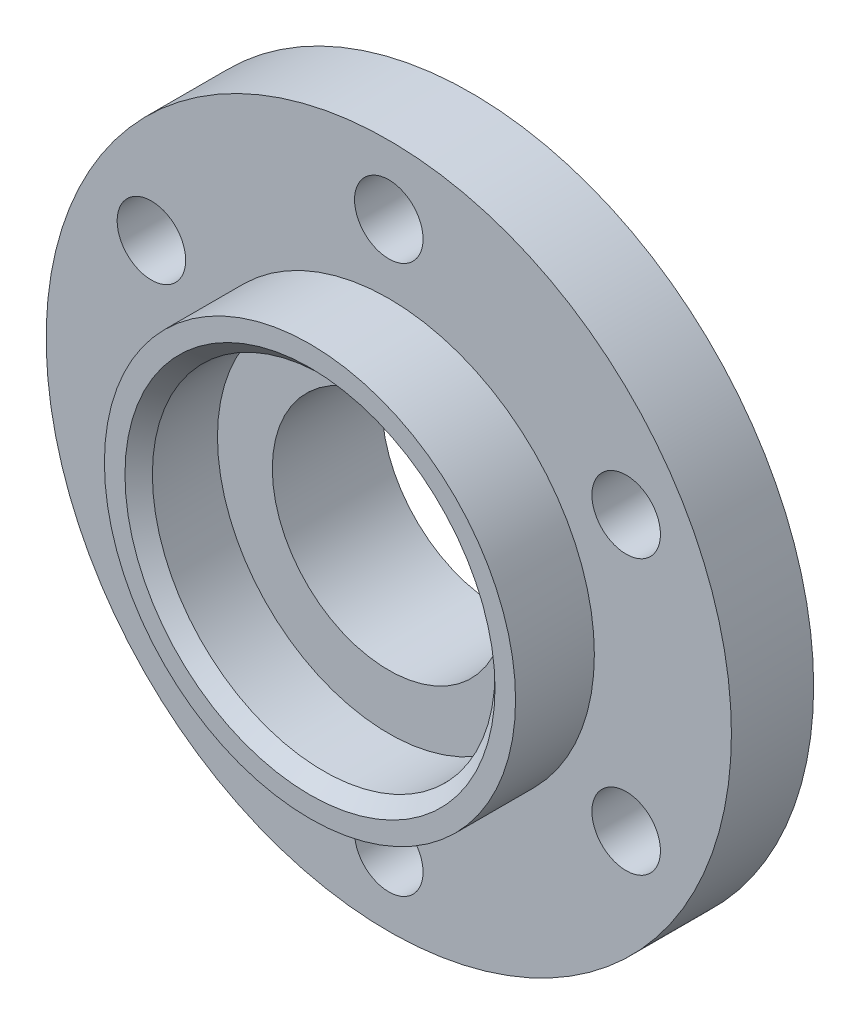
ISO-10303-21;
HEADER;
FILE_DESCRIPTION(('STEP AP214'),'2;1');
FILE_NAME('part.step','',(''),(''),'','','');
FILE_SCHEMA(('AUTOMOTIVE_DESIGN { 1 0 10303 214 1 1 1 1 }'));
ENDSEC;
DATA;
#1=APPLICATION_CONTEXT('core data for automotive mechanical design processes');
#2=APPLICATION_PROTOCOL_DEFINITION('international standard','automotive_design',2000,#1);
#3=PRODUCT_CONTEXT('',#1,'mechanical');
#4=PRODUCT('Part','Part','',(#3));
#5=PRODUCT_RELATED_PRODUCT_CATEGORY('part','',(#4));
#6=PRODUCT_DEFINITION_FORMATION('','',#4);
#7=PRODUCT_DEFINITION_CONTEXT('part definition',#1,'design');
#8=PRODUCT_DEFINITION('design','',#6,#7);
#9=PRODUCT_DEFINITION_SHAPE('','',#8);
#10=(LENGTH_UNIT() NAMED_UNIT(*) SI_UNIT(.MILLI.,.METRE.));
#11=(NAMED_UNIT(*) PLANE_ANGLE_UNIT() SI_UNIT($,.RADIAN.));
#12=(NAMED_UNIT(*) SI_UNIT($,.STERADIAN.) SOLID_ANGLE_UNIT());
#13=UNCERTAINTY_MEASURE_WITH_UNIT(LENGTH_MEASURE(1.E-05),#10,'distance_accuracy_value','');
#14=(GEOMETRIC_REPRESENTATION_CONTEXT(3) GLOBAL_UNCERTAINTY_ASSIGNED_CONTEXT((#13)) GLOBAL_UNIT_ASSIGNED_CONTEXT((#10,
#11,#12)) REPRESENTATION_CONTEXT('',''));
#15=CARTESIAN_POINT('',(0.,0.,0.));
#16=DIRECTION('',(0.,0.,1.));
#17=DIRECTION('',(1.,0.,0.));
#18=AXIS2_PLACEMENT_3D('',#15,#16,#17);
#19=CARTESIAN_POINT('',(0.,0.,0.));
#20=DIRECTION('',(0.,0.,1.));
#21=DIRECTION('',(1.,0.,0.));
#22=AXIS2_PLACEMENT_3D('',#19,#20,#21);
#23=PLANE('',#22);
#24=CARTESIAN_POINT('',(-17.3205080756887,10.0000000000002,0.));
#25=DIRECTION('',(0.,0.,-1.));
#26=DIRECTION('',(-1.,0.,0.));
#27=AXIS2_PLACEMENT_3D('',#24,#25,#26);
#28=CIRCLE('',#27,2.49999999999999);
#29=CARTESIAN_POINT('',(-19.8205080756886,10.0000000000002,0.));
#30=VERTEX_POINT('',#29);
#31=EDGE_CURVE('E71',#30,#30,#28,.T.);
#32=ORIENTED_EDGE('',*,*,#31,.F.);
#33=EDGE_LOOP('',(#32));
#34=FACE_BOUND('',#33,.T.);
#35=CARTESIAN_POINT('',(-17.3205080756889,-9.99999999999984,0.));
#36=DIRECTION('',(0.,0.,-1.));
#37=DIRECTION('',(-1.,0.,0.));
#38=AXIS2_PLACEMENT_3D('',#35,#36,#37);
#39=CIRCLE('',#38,2.49999999999999);
#40=CARTESIAN_POINT('',(-19.8205080756889,-9.99999999999984,0.));
#41=VERTEX_POINT('',#40);
#42=EDGE_CURVE('E61',#41,#41,#39,.T.);
#43=ORIENTED_EDGE('',*,*,#42,.F.);
#44=EDGE_LOOP('',(#43));
#45=FACE_BOUND('',#44,.T.);
#46=CARTESIAN_POINT('',(0.,-20.,0.));
#47=DIRECTION('',(0.,0.,-1.));
#48=DIRECTION('',(-1.,0.,0.));
#49=AXIS2_PLACEMENT_3D('',#46,#47,#48);
#50=CIRCLE('',#49,2.49999999999999);
#51=CARTESIAN_POINT('',(-2.49999999999999,-20.,0.));
#52=VERTEX_POINT('',#51);
#53=EDGE_CURVE('E58',#52,#52,#50,.T.);
#54=ORIENTED_EDGE('',*,*,#53,.F.);
#55=EDGE_LOOP('',(#54));
#56=FACE_BOUND('',#55,.T.);
#57=CARTESIAN_POINT('',(17.3205080756887,-10.0000000000001,0.));
#58=DIRECTION('',(0.,0.,-1.));
#59=DIRECTION('',(-1.,0.,0.));
#60=AXIS2_PLACEMENT_3D('',#57,#58,#59);
#61=CIRCLE('',#60,2.49999999999999);
#62=CARTESIAN_POINT('',(14.8205080756887,-10.0000000000001,0.));
#63=VERTEX_POINT('',#62);
#64=EDGE_CURVE('E57',#63,#63,#61,.T.);
#65=ORIENTED_EDGE('',*,*,#64,.F.);
#66=EDGE_LOOP('',(#65));
#67=FACE_BOUND('',#66,.T.);
#68=CARTESIAN_POINT('',(17.3205080756888,9.99999999999996,0.));
#69=DIRECTION('',(0.,0.,-1.));
#70=DIRECTION('',(-1.,0.,0.));
#71=AXIS2_PLACEMENT_3D('',#68,#69,#70);
#72=CIRCLE('',#71,2.49999999999999);
#73=CARTESIAN_POINT('',(14.8205080756888,9.99999999999996,0.));
#74=VERTEX_POINT('',#73);
#75=EDGE_CURVE('E54',#74,#74,#72,.T.);
#76=ORIENTED_EDGE('',*,*,#75,.F.);
#77=EDGE_LOOP('',(#76));
#78=FACE_BOUND('',#77,.T.);
#79=CARTESIAN_POINT('',(0.,20.,0.));
#80=DIRECTION('',(0.,0.,-1.));
#81=DIRECTION('',(-1.,0.,0.));
#82=AXIS2_PLACEMENT_3D('',#79,#80,#81);
#83=CIRCLE('',#82,2.49999999999999);
#84=CARTESIAN_POINT('',(-2.49999999999999,20.,0.));
#85=VERTEX_POINT('',#84);
#86=EDGE_CURVE('E53',#85,#85,#83,.T.);
#87=ORIENTED_EDGE('',*,*,#86,.F.);
#88=EDGE_LOOP('',(#87));
#89=FACE_BOUND('',#88,.T.);
#90=CARTESIAN_POINT('',(0.,0.,0.));
#91=DIRECTION('',(0.,0.,1.));
#92=DIRECTION('',(1.,0.,0.));
#93=AXIS2_PLACEMENT_3D('',#90,#91,#92);
#94=CIRCLE('',#93,25.);
#95=CARTESIAN_POINT('',(25.,0.,0.));
#96=VERTEX_POINT('',#95);
#97=EDGE_CURVE('E91',#96,#96,#94,.T.);
#98=ORIENTED_EDGE('',*,*,#97,.F.);
#99=EDGE_LOOP('',(#98));
#100=FACE_BOUND('',#99,.T.);
#101=CARTESIAN_POINT('',(0.,0.,0.));
#102=DIRECTION('',(0.,0.,1.));
#103=DIRECTION('',(1.,0.,0.));
#104=AXIS2_PLACEMENT_3D('',#101,#102,#103);
#105=CIRCLE('',#104,14.);
#106=CARTESIAN_POINT('',(14.,0.,0.));
#107=VERTEX_POINT('',#106);
#108=EDGE_CURVE('E102',#107,#107,#105,.F.);
#109=ORIENTED_EDGE('',*,*,#108,.F.);
#110=EDGE_LOOP('',(#109));
#111=FACE_BOUND('',#110,.T.);
#112=ADVANCED_FACE('F33',(#34,#45,#56,#67,#78,#89,#100,#111),#23,.F.);
#113=CARTESIAN_POINT('',(0.,0.,6.));
#114=DIRECTION('',(0.,0.,1.));
#115=DIRECTION('',(1.,0.,0.));
#116=AXIS2_PLACEMENT_3D('',#113,#114,#115);
#117=PLANE('',#116);
#118=CARTESIAN_POINT('',(-17.3205080756887,10.0000000000002,6.));
#119=DIRECTION('',(0.,0.,1.));
#120=DIRECTION('',(1.,0.,0.));
#121=AXIS2_PLACEMENT_3D('',#118,#119,#120);
#122=CIRCLE('',#121,2.49999999999999);
#123=CARTESIAN_POINT('',(-14.8205080756887,10.0000000000002,6.));
#124=VERTEX_POINT('',#123);
#125=EDGE_CURVE('E37',#124,#124,#122,.T.);
#126=ORIENTED_EDGE('',*,*,#125,.F.);
#127=EDGE_LOOP('',(#126));
#128=FACE_BOUND('',#127,.T.);
#129=CARTESIAN_POINT('',(-17.3205080756889,-9.99999999999984,6.));
#130=DIRECTION('',(0.,0.,1.));
#131=DIRECTION('',(1.,0.,0.));
#132=AXIS2_PLACEMENT_3D('',#129,#130,#131);
#133=CIRCLE('',#132,2.49999999999999);
#134=CARTESIAN_POINT('',(-14.8205080756889,-9.99999999999984,6.));
#135=VERTEX_POINT('',#134);
#136=EDGE_CURVE('E59',#135,#135,#133,.T.);
#137=ORIENTED_EDGE('',*,*,#136,.F.);
#138=EDGE_LOOP('',(#137));
#139=FACE_BOUND('',#138,.T.);
#140=CARTESIAN_POINT('',(0.,-20.,6.));
#141=DIRECTION('',(0.,0.,1.));
#142=DIRECTION('',(1.,0.,0.));
#143=AXIS2_PLACEMENT_3D('',#140,#141,#142);
#144=CIRCLE('',#143,2.49999999999999);
#145=CARTESIAN_POINT('',(2.49999999999999,-20.,6.));
#146=VERTEX_POINT('',#145);
#147=EDGE_CURVE('E55',#146,#146,#144,.T.);
#148=ORIENTED_EDGE('',*,*,#147,.F.);
#149=EDGE_LOOP('',(#148));
#150=FACE_BOUND('',#149,.T.);
#151=CARTESIAN_POINT('',(17.3205080756887,-10.0000000000001,6.));
#152=DIRECTION('',(0.,0.,1.));
#153=DIRECTION('',(1.,0.,0.));
#154=AXIS2_PLACEMENT_3D('',#151,#152,#153);
#155=CIRCLE('',#154,2.49999999999999);
#156=CARTESIAN_POINT('',(19.8205080756887,-10.0000000000001,6.));
#157=VERTEX_POINT('',#156);
#158=EDGE_CURVE('E77',#157,#157,#155,.T.);
#159=ORIENTED_EDGE('',*,*,#158,.F.);
#160=EDGE_LOOP('',(#159));
#161=FACE_BOUND('',#160,.T.);
#162=CARTESIAN_POINT('',(17.3205080756888,9.99999999999996,6.));
#163=DIRECTION('',(0.,0.,1.));
#164=DIRECTION('',(1.,0.,0.));
#165=AXIS2_PLACEMENT_3D('',#162,#163,#164);
#166=CIRCLE('',#165,2.49999999999999);
#167=CARTESIAN_POINT('',(19.8205080756888,9.99999999999996,6.));
#168=VERTEX_POINT('',#167);
#169=EDGE_CURVE('E50',#168,#168,#166,.T.);
#170=ORIENTED_EDGE('',*,*,#169,.F.);
#171=EDGE_LOOP('',(#170));
#172=FACE_BOUND('',#171,.T.);
#173=CARTESIAN_POINT('',(0.,20.,6.));
#174=DIRECTION('',(0.,0.,1.));
#175=DIRECTION('',(1.,0.,0.));
#176=AXIS2_PLACEMENT_3D('',#173,#174,#175);
#177=CIRCLE('',#176,2.49999999999999);
#178=CARTESIAN_POINT('',(2.5,20.,6.));
#179=VERTEX_POINT('',#178);
#180=EDGE_CURVE('E84',#179,#179,#177,.T.);
#181=ORIENTED_EDGE('',*,*,#180,.F.);
#182=EDGE_LOOP('',(#181));
#183=FACE_BOUND('',#182,.T.);
#184=CARTESIAN_POINT('',(0.,0.,6.));
#185=DIRECTION('',(0.,0.,1.));
#186=DIRECTION('',(1.,0.,0.));
#187=AXIS2_PLACEMENT_3D('',#184,#185,#186);
#188=CIRCLE('',#187,25.);
#189=CARTESIAN_POINT('',(25.,0.,6.));
#190=VERTEX_POINT('',#189);
#191=EDGE_CURVE('E94',#190,#190,#188,.T.);
#192=ORIENTED_EDGE('',*,*,#191,.T.);
#193=EDGE_LOOP('',(#192));
#194=FACE_BOUND('',#193,.T.);
#195=CARTESIAN_POINT('',(0.,0.,6.));
#196=DIRECTION('',(0.,0.,1.));
#197=DIRECTION('',(1.,0.,0.));
#198=AXIS2_PLACEMENT_3D('',#195,#196,#197);
#199=CIRCLE('',#198,15.);
#200=CARTESIAN_POINT('',(15.,0.,6.));
#201=VERTEX_POINT('',#200);
#202=EDGE_CURVE('E87',#201,#201,#199,.T.);
#203=ORIENTED_EDGE('',*,*,#202,.F.);
#204=EDGE_LOOP('',(#203));
#205=FACE_BOUND('',#204,.T.);
#206=ADVANCED_FACE('F123',(#128,#139,#150,#161,#172,#183,#194,#205),#117,.T.);
#207=CARTESIAN_POINT('',(0.,0.,6.));
#208=DIRECTION('',(0.,0.,-1.));
#209=DIRECTION('',(-1.,0.,0.));
#210=AXIS2_PLACEMENT_3D('',#207,#208,#209);
#211=CYLINDRICAL_SURFACE('',#210,25.);
#212=ORIENTED_EDGE('',*,*,#191,.F.);
#213=EDGE_LOOP('',(#212));
#214=FACE_BOUND('',#213,.T.);
#215=ORIENTED_EDGE('',*,*,#97,.T.);
#216=EDGE_LOOP('',(#215));
#217=FACE_BOUND('',#216,.T.);
#218=ADVANCED_FACE('F129',(#214,#217),#211,.T.);
#219=CARTESIAN_POINT('',(0.,0.,11.75));
#220=DIRECTION('',(0.,0.,1.));
#221=DIRECTION('',(1.,0.,0.));
#222=AXIS2_PLACEMENT_3D('',#219,#220,#221);
#223=PLANE('',#222);
#224=CARTESIAN_POINT('',(0.,0.,11.75));
#225=DIRECTION('',(0.,0.,1.));
#226=DIRECTION('',(1.,0.,0.));
#227=AXIS2_PLACEMENT_3D('',#224,#225,#226);
#228=CIRCLE('',#227,13.5);
#229=CARTESIAN_POINT('',(13.5,0.,11.75));
#230=VERTEX_POINT('',#229);
#231=EDGE_CURVE('E10',#230,#230,#228,.F.);
#232=ORIENTED_EDGE('',*,*,#231,.T.);
#233=EDGE_LOOP('',(#232));
#234=FACE_BOUND('',#233,.T.);
#235=CARTESIAN_POINT('',(0.,0.,11.75));
#236=DIRECTION('',(0.,0.,1.));
#237=DIRECTION('',(1.,0.,0.));
#238=AXIS2_PLACEMENT_3D('',#235,#236,#237);
#239=CIRCLE('',#238,15.);
#240=CARTESIAN_POINT('',(15.,0.,11.75));
#241=VERTEX_POINT('',#240);
#242=EDGE_CURVE('E88',#241,#241,#239,.T.);
#243=ORIENTED_EDGE('',*,*,#242,.T.);
#244=EDGE_LOOP('',(#243));
#245=FACE_BOUND('',#244,.T.);
#246=ADVANCED_FACE('F136',(#234,#245),#223,.T.);
#247=CARTESIAN_POINT('',(0.,0.,11.75));
#248=DIRECTION('',(0.,0.,-1.));
#249=DIRECTION('',(-1.,0.,0.));
#250=AXIS2_PLACEMENT_3D('',#247,#248,#249);
#251=CYLINDRICAL_SURFACE('',#250,15.);
#252=ORIENTED_EDGE('',*,*,#242,.F.);
#253=EDGE_LOOP('',(#252));
#254=FACE_BOUND('',#253,.T.);
#255=ORIENTED_EDGE('',*,*,#202,.T.);
#256=EDGE_LOOP('',(#255));
#257=FACE_BOUND('',#256,.T.);
#258=ADVANCED_FACE('F141',(#254,#257),#251,.T.);
#259=CARTESIAN_POINT('',(0.,0.,11.75));
#260=DIRECTION('',(0.,0.,-1.));
#261=DIRECTION('',(-1.,0.,0.));
#262=AXIS2_PLACEMENT_3D('',#259,#260,#261);
#263=CYLINDRICAL_SURFACE('',#262,12.5);
#264=CARTESIAN_POINT('',(0.,0.,10.75));
#265=DIRECTION('',(0.,0.,1.));
#266=DIRECTION('',(1.,0.,0.));
#267=AXIS2_PLACEMENT_3D('',#264,#265,#266);
#268=CIRCLE('',#267,12.5);
#269=CARTESIAN_POINT('',(12.5,0.,10.75));
#270=VERTEX_POINT('',#269);
#271=EDGE_CURVE('E41',#270,#270,#268,.T.);
#272=ORIENTED_EDGE('',*,*,#271,.T.);
#273=EDGE_LOOP('',(#272));
#274=FACE_BOUND('',#273,.T.);
#275=CARTESIAN_POINT('',(0.,0.,6.));
#276=DIRECTION('',(0.,0.,1.));
#277=DIRECTION('',(1.,0.,0.));
#278=AXIS2_PLACEMENT_3D('',#275,#276,#277);
#279=CIRCLE('',#278,12.5);
#280=CARTESIAN_POINT('',(12.5,0.,6.));
#281=VERTEX_POINT('',#280);
#282=EDGE_CURVE('E97',#281,#281,#279,.F.);
#283=ORIENTED_EDGE('',*,*,#282,.T.);
#284=EDGE_LOOP('',(#283));
#285=FACE_BOUND('',#284,.T.);
#286=ADVANCED_FACE('F154',(#274,#285),#263,.F.);
#287=CARTESIAN_POINT('',(0.,0.,6.));
#288=DIRECTION('',(0.,0.,1.));
#289=DIRECTION('',(1.,0.,0.));
#290=AXIS2_PLACEMENT_3D('',#287,#288,#289);
#291=CIRCLE('',#290,8.5);
#292=CARTESIAN_POINT('',(8.5,0.,6.));
#293=VERTEX_POINT('',#292);
#294=EDGE_CURVE('E193',#293,#293,#291,.T.);
#295=ORIENTED_EDGE('',*,*,#294,.F.);
#296=EDGE_LOOP('',(#295));
#297=FACE_BOUND('',#296,.T.);
#298=ORIENTED_EDGE('',*,*,#282,.F.);
#299=EDGE_LOOP('',(#298));
#300=FACE_BOUND('',#299,.T.);
#301=ADVANCED_FACE('F118',(#297,#300),#117,.T.);
#302=CARTESIAN_POINT('',(0.,0.,-2.));
#303=DIRECTION('',(0.,0.,-1.));
#304=DIRECTION('',(-1.,0.,0.));
#305=AXIS2_PLACEMENT_3D('',#302,#303,#304);
#306=PLANE('',#305);
#307=CARTESIAN_POINT('',(0.,0.,-2.));
#308=DIRECTION('',(0.,0.,-1.));
#309=DIRECTION('',(-1.,0.,0.));
#310=AXIS2_PLACEMENT_3D('',#307,#308,#309);
#311=CIRCLE('',#310,8.5);
#312=CARTESIAN_POINT('',(-8.5,0.,-2.));
#313=VERTEX_POINT('',#312);
#314=EDGE_CURVE('E196',#313,#313,#311,.T.);
#315=ORIENTED_EDGE('',*,*,#314,.F.);
#316=EDGE_LOOP('',(#315));
#317=FACE_BOUND('',#316,.T.);
#318=CARTESIAN_POINT('',(0.,0.,-2.));
#319=DIRECTION('',(0.,0.,-1.));
#320=DIRECTION('',(-1.,0.,0.));
#321=AXIS2_PLACEMENT_3D('',#318,#319,#320);
#322=CIRCLE('',#321,12.);
#323=CARTESIAN_POINT('',(-12.,0.,-2.));
#324=VERTEX_POINT('',#323);
#325=EDGE_CURVE('E46',#324,#324,#322,.T.);
#326=ORIENTED_EDGE('',*,*,#325,.T.);
#327=EDGE_LOOP('',(#326));
#328=FACE_BOUND('',#327,.T.);
#329=ADVANCED_FACE('F107',(#317,#328),#306,.T.);
#330=CARTESIAN_POINT('',(0.,0.,0.));
#331=DIRECTION('',(0.,0.,-1.));
#332=DIRECTION('',(-1.,0.,0.));
#333=AXIS2_PLACEMENT_3D('',#330,#331,#332);
#334=TOROIDAL_SURFACE('',#333,12.,2.);
#335=ORIENTED_EDGE('',*,*,#108,.T.);
#336=EDGE_LOOP('',(#335));
#337=FACE_BOUND('',#336,.T.);
#338=ORIENTED_EDGE('',*,*,#325,.F.);
#339=EDGE_LOOP('',(#338));
#340=FACE_BOUND('',#339,.T.);
#341=ADVANCED_FACE('F109',(#337,#340),#334,.T.);
#342=CARTESIAN_POINT('',(0.,0.,10.75));
#343=DIRECTION('',(0.,0.,1.));
#344=DIRECTION('',(1.,0.,0.));
#345=AXIS2_PLACEMENT_3D('',#342,#343,#344);
#346=CONICAL_SURFACE('',#345,12.5,0.785398163397447);
#347=ORIENTED_EDGE('',*,*,#231,.F.);
#348=EDGE_LOOP('',(#347));
#349=FACE_BOUND('',#348,.T.);
#350=ORIENTED_EDGE('',*,*,#271,.F.);
#351=EDGE_LOOP('',(#350));
#352=FACE_BOUND('',#351,.T.);
#353=ADVANCED_FACE('F35',(#349,#352),#346,.F.);
#354=CARTESIAN_POINT('',(0.,20.,0.));
#355=DIRECTION('',(0.,0.,-1.));
#356=DIRECTION('',(-1.,0.,0.));
#357=AXIS2_PLACEMENT_3D('',#354,#355,#356);
#358=CYLINDRICAL_SURFACE('',#357,2.49999999999999);
#359=ORIENTED_EDGE('',*,*,#180,.T.);
#360=EDGE_LOOP('',(#359));
#361=FACE_BOUND('',#360,.T.);
#362=ORIENTED_EDGE('',*,*,#86,.T.);
#363=EDGE_LOOP('',(#362));
#364=FACE_BOUND('',#363,.T.);
#365=ADVANCED_FACE('F116',(#361,#364),#358,.F.);
#366=CARTESIAN_POINT('',(17.3205080756888,9.99999999999996,0.));
#367=DIRECTION('',(0.,0.,-1.));
#368=DIRECTION('',(-1.,0.,0.));
#369=AXIS2_PLACEMENT_3D('',#366,#367,#368);
#370=CYLINDRICAL_SURFACE('',#369,2.49999999999999);
#371=ORIENTED_EDGE('',*,*,#169,.T.);
#372=EDGE_LOOP('',(#371));
#373=FACE_BOUND('',#372,.T.);
#374=ORIENTED_EDGE('',*,*,#75,.T.);
#375=EDGE_LOOP('',(#374));
#376=FACE_BOUND('',#375,.T.);
#377=ADVANCED_FACE('F165',(#373,#376),#370,.F.);
#378=CARTESIAN_POINT('',(17.3205080756887,-10.0000000000001,0.));
#379=DIRECTION('',(0.,0.,-1.));
#380=DIRECTION('',(-1.,0.,0.));
#381=AXIS2_PLACEMENT_3D('',#378,#379,#380);
#382=CYLINDRICAL_SURFACE('',#381,2.49999999999999);
#383=ORIENTED_EDGE('',*,*,#158,.T.);
#384=EDGE_LOOP('',(#383));
#385=FACE_BOUND('',#384,.T.);
#386=ORIENTED_EDGE('',*,*,#64,.T.);
#387=EDGE_LOOP('',(#386));
#388=FACE_BOUND('',#387,.T.);
#389=ADVANCED_FACE('F169',(#385,#388),#382,.F.);
#390=CARTESIAN_POINT('',(0.,-20.,0.));
#391=DIRECTION('',(0.,0.,-1.));
#392=DIRECTION('',(-1.,0.,0.));
#393=AXIS2_PLACEMENT_3D('',#390,#391,#392);
#394=CYLINDRICAL_SURFACE('',#393,2.49999999999999);
#395=ORIENTED_EDGE('',*,*,#147,.T.);
#396=EDGE_LOOP('',(#395));
#397=FACE_BOUND('',#396,.T.);
#398=ORIENTED_EDGE('',*,*,#53,.T.);
#399=EDGE_LOOP('',(#398));
#400=FACE_BOUND('',#399,.T.);
#401=ADVANCED_FACE('F173',(#397,#400),#394,.F.);
#402=CARTESIAN_POINT('',(-17.3205080756889,-9.99999999999984,0.));
#403=DIRECTION('',(0.,0.,-1.));
#404=DIRECTION('',(-1.,0.,0.));
#405=AXIS2_PLACEMENT_3D('',#402,#403,#404);
#406=CYLINDRICAL_SURFACE('',#405,2.49999999999999);
#407=ORIENTED_EDGE('',*,*,#136,.T.);
#408=EDGE_LOOP('',(#407));
#409=FACE_BOUND('',#408,.T.);
#410=ORIENTED_EDGE('',*,*,#42,.T.);
#411=EDGE_LOOP('',(#410));
#412=FACE_BOUND('',#411,.T.);
#413=ADVANCED_FACE('F177',(#409,#412),#406,.F.);
#414=CARTESIAN_POINT('',(-17.3205080756887,10.0000000000002,0.));
#415=DIRECTION('',(0.,0.,-1.));
#416=DIRECTION('',(-1.,0.,0.));
#417=AXIS2_PLACEMENT_3D('',#414,#415,#416);
#418=CYLINDRICAL_SURFACE('',#417,2.49999999999999);
#419=ORIENTED_EDGE('',*,*,#125,.T.);
#420=EDGE_LOOP('',(#419));
#421=FACE_BOUND('',#420,.T.);
#422=ORIENTED_EDGE('',*,*,#31,.T.);
#423=EDGE_LOOP('',(#422));
#424=FACE_BOUND('',#423,.T.);
#425=ADVANCED_FACE('F181',(#421,#424),#418,.F.);
#426=CARTESIAN_POINT('',(0.,0.,11.75));
#427=DIRECTION('',(0.,0.,-1.));
#428=DIRECTION('',(-1.,0.,0.));
#429=AXIS2_PLACEMENT_3D('',#426,#427,#428);
#430=CYLINDRICAL_SURFACE('',#429,8.5);
#431=ORIENTED_EDGE('',*,*,#294,.T.);
#432=EDGE_LOOP('',(#431));
#433=FACE_BOUND('',#432,.T.);
#434=ORIENTED_EDGE('',*,*,#314,.T.);
#435=EDGE_LOOP('',(#434));
#436=FACE_BOUND('',#435,.T.);
#437=ADVANCED_FACE('F184',(#433,#436),#430,.F.);
#438=CLOSED_SHELL('',(#112,#206,#218,#246,#258,#286,#301,#329,#341,#353,#365,#377,#389,#401,
#413,#425,#437));
#439=MANIFOLD_SOLID_BREP('B2',#438);
#440=ADVANCED_BREP_SHAPE_REPRESENTATION('',(#18,#439),#14);
#441=SHAPE_DEFINITION_REPRESENTATION(#9,#440);
ENDSEC;
END-ISO-10303-21;
